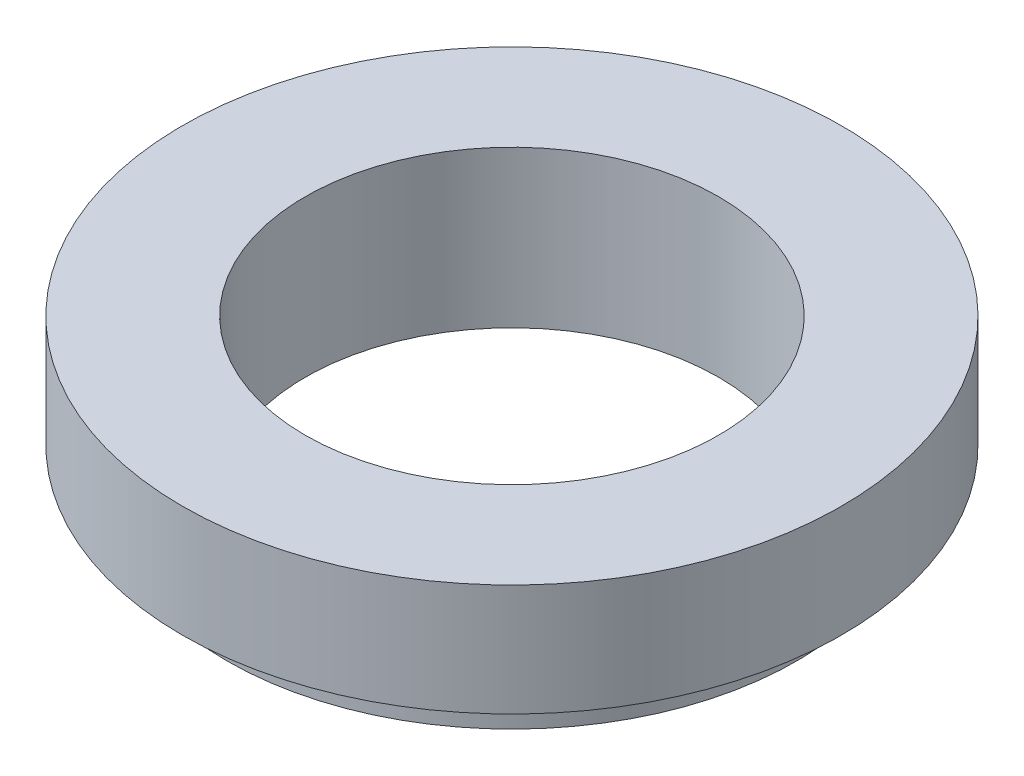
ISO-10303-21;
HEADER;
FILE_DESCRIPTION(('STEP AP214'),'2;1');
FILE_NAME('part.step','',(''),(''),'','','');
FILE_SCHEMA(('AUTOMOTIVE_DESIGN { 1 0 10303 214 1 1 1 1 }'));
ENDSEC;
DATA;
#1=APPLICATION_CONTEXT('core data for automotive mechanical design processes');
#2=APPLICATION_PROTOCOL_DEFINITION('international standard','automotive_design',2000,#1);
#3=PRODUCT_CONTEXT('',#1,'mechanical');
#4=PRODUCT('Part','Part','',(#3));
#5=PRODUCT_RELATED_PRODUCT_CATEGORY('part','',(#4));
#6=PRODUCT_DEFINITION_FORMATION('','',#4);
#7=PRODUCT_DEFINITION_CONTEXT('part definition',#1,'design');
#8=PRODUCT_DEFINITION('design','',#6,#7);
#9=PRODUCT_DEFINITION_SHAPE('','',#8);
#10=(LENGTH_UNIT() NAMED_UNIT(*) SI_UNIT(.MILLI.,.METRE.));
#11=(NAMED_UNIT(*) PLANE_ANGLE_UNIT() SI_UNIT($,.RADIAN.));
#12=(NAMED_UNIT(*) SI_UNIT($,.STERADIAN.) SOLID_ANGLE_UNIT());
#13=UNCERTAINTY_MEASURE_WITH_UNIT(LENGTH_MEASURE(1.E-05),#10,'distance_accuracy_value','');
#14=(GEOMETRIC_REPRESENTATION_CONTEXT(3) GLOBAL_UNCERTAINTY_ASSIGNED_CONTEXT((#13)) GLOBAL_UNIT_ASSIGNED_CONTEXT((#10,
#11,#12)) REPRESENTATION_CONTEXT('',''));
#15=CARTESIAN_POINT('',(0.,0.,0.));
#16=DIRECTION('',(0.,0.,1.));
#17=DIRECTION('',(1.,0.,0.));
#18=AXIS2_PLACEMENT_3D('',#15,#16,#17);
#19=CARTESIAN_POINT('',(29.5000000000003,0.,0.));
#20=DIRECTION('',(0.,-1.,0.));
#21=DIRECTION('',(0.,0.,-1.00000000000001));
#22=AXIS2_PLACEMENT_3D('',#19,#20,#21);
#23=PLANE('',#22);
#24=CARTESIAN_POINT('',(0.,0.,0.));
#25=DIRECTION('',(0.,1.,0.));
#26=DIRECTION('',(0.,0.,1.00000000000001));
#27=AXIS2_PLACEMENT_3D('',#24,#25,#26);
#28=CIRCLE('',#27,18.5);
#29=CARTESIAN_POINT('',(0.,0.,18.5000000000001));
#30=VERTEX_POINT('',#29);
#31=EDGE_CURVE('E12',#30,#30,#28,.T.);
#32=ORIENTED_EDGE('',*,*,#31,.F.);
#33=EDGE_LOOP('',(#32));
#34=FACE_BOUND('',#33,.T.);
#35=CARTESIAN_POINT('',(0.,0.,0.));
#36=DIRECTION('',(0.,1.,0.));
#37=DIRECTION('',(0.,0.,1.00000000000001));
#38=AXIS2_PLACEMENT_3D('',#35,#36,#37);
#39=CIRCLE('',#38,29.5);
#40=CARTESIAN_POINT('',(0.,0.,29.5000000000002));
#41=VERTEX_POINT('',#40);
#42=EDGE_CURVE('E63',#41,#41,#39,.T.);
#43=ORIENTED_EDGE('',*,*,#42,.T.);
#44=EDGE_LOOP('',(#43));
#45=FACE_BOUND('',#44,.T.);
#46=ADVANCED_FACE('F41',(#34,#45),#23,.F.);
#47=CARTESIAN_POINT('',(0.,0.,0.));
#48=DIRECTION('',(0.,1.,0.));
#49=DIRECTION('',(0.,0.,1.00000000000001));
#50=AXIS2_PLACEMENT_3D('',#47,#48,#49);
#51=CYLINDRICAL_SURFACE('',#50,18.5);
#52=CARTESIAN_POINT('',(0.,-14.,0.));
#53=DIRECTION('',(0.,1.,0.));
#54=DIRECTION('',(0.,0.,1.00000000000001));
#55=AXIS2_PLACEMENT_3D('',#52,#53,#54);
#56=CIRCLE('',#55,18.5);
#57=CARTESIAN_POINT('',(0.,-14.,18.5000000000001));
#58=VERTEX_POINT('',#57);
#59=EDGE_CURVE('E47',#58,#58,#56,.T.);
#60=ORIENTED_EDGE('',*,*,#59,.F.);
#61=EDGE_LOOP('',(#60));
#62=FACE_BOUND('',#61,.T.);
#63=ORIENTED_EDGE('',*,*,#31,.T.);
#64=EDGE_LOOP('',(#63));
#65=FACE_BOUND('',#64,.T.);
#66=ADVANCED_FACE('F88',(#62,#65),#51,.F.);
#67=CARTESIAN_POINT('',(18.5000000000001,-14.,0.));
#68=DIRECTION('',(0.,1.,0.));
#69=DIRECTION('',(0.,0.,1.00000000000001));
#70=AXIS2_PLACEMENT_3D('',#67,#68,#69);
#71=PLANE('',#70);
#72=CARTESIAN_POINT('',(0.,-14.,0.));
#73=DIRECTION('',(0.,1.,0.));
#74=DIRECTION('',(0.,0.,1.00000000000001));
#75=AXIS2_PLACEMENT_3D('',#72,#73,#74);
#76=CIRCLE('',#75,25.5);
#77=CARTESIAN_POINT('',(0.,-14.,25.5000000000002));
#78=VERTEX_POINT('',#77);
#79=EDGE_CURVE('E51',#78,#78,#76,.T.);
#80=ORIENTED_EDGE('',*,*,#79,.F.);
#81=EDGE_LOOP('',(#80));
#82=FACE_BOUND('',#81,.T.);
#83=ORIENTED_EDGE('',*,*,#59,.T.);
#84=EDGE_LOOP('',(#83));
#85=FACE_BOUND('',#84,.T.);
#86=ADVANCED_FACE('F83',(#82,#85),#71,.F.);
#87=CARTESIAN_POINT('',(0.,0.,0.));
#88=DIRECTION('',(0.,1.,0.));
#89=DIRECTION('',(0.,0.,1.00000000000001));
#90=AXIS2_PLACEMENT_3D('',#87,#88,#89);
#91=CYLINDRICAL_SURFACE('',#90,25.5);
#92=CARTESIAN_POINT('',(0.,-9.99999999999999,0.));
#93=DIRECTION('',(0.,1.,0.));
#94=DIRECTION('',(0.,0.,1.00000000000001));
#95=AXIS2_PLACEMENT_3D('',#92,#93,#94);
#96=CIRCLE('',#95,25.5);
#97=CARTESIAN_POINT('',(0.,-9.99999999999999,25.5000000000002));
#98=VERTEX_POINT('',#97);
#99=EDGE_CURVE('E55',#98,#98,#96,.T.);
#100=ORIENTED_EDGE('',*,*,#99,.F.);
#101=EDGE_LOOP('',(#100));
#102=FACE_BOUND('',#101,.T.);
#103=ORIENTED_EDGE('',*,*,#79,.T.);
#104=EDGE_LOOP('',(#103));
#105=FACE_BOUND('',#104,.T.);
#106=ADVANCED_FACE('F77',(#102,#105),#91,.T.);
#107=CARTESIAN_POINT('',(25.5000000000002,-9.99999999999999,0.));
#108=DIRECTION('',(0.,1.,0.));
#109=DIRECTION('',(0.,0.,1.00000000000001));
#110=AXIS2_PLACEMENT_3D('',#107,#108,#109);
#111=PLANE('',#110);
#112=CARTESIAN_POINT('',(0.,-9.99999999999999,0.));
#113=DIRECTION('',(0.,1.,0.));
#114=DIRECTION('',(0.,0.,1.00000000000001));
#115=AXIS2_PLACEMENT_3D('',#112,#113,#114);
#116=CIRCLE('',#115,29.5);
#117=CARTESIAN_POINT('',(0.,-9.99999999999999,29.5000000000002));
#118=VERTEX_POINT('',#117);
#119=EDGE_CURVE('E60',#118,#118,#116,.T.);
#120=ORIENTED_EDGE('',*,*,#119,.F.);
#121=EDGE_LOOP('',(#120));
#122=FACE_BOUND('',#121,.T.);
#123=ORIENTED_EDGE('',*,*,#99,.T.);
#124=EDGE_LOOP('',(#123));
#125=FACE_BOUND('',#124,.T.);
#126=ADVANCED_FACE('F71',(#122,#125),#111,.F.);
#127=CARTESIAN_POINT('',(0.,0.,0.));
#128=DIRECTION('',(0.,1.,0.));
#129=DIRECTION('',(0.,0.,1.00000000000001));
#130=AXIS2_PLACEMENT_3D('',#127,#128,#129);
#131=CYLINDRICAL_SURFACE('',#130,29.5);
#132=ORIENTED_EDGE('',*,*,#42,.F.);
#133=EDGE_LOOP('',(#132));
#134=FACE_BOUND('',#133,.T.);
#135=ORIENTED_EDGE('',*,*,#119,.T.);
#136=EDGE_LOOP('',(#135));
#137=FACE_BOUND('',#136,.T.);
#138=ADVANCED_FACE('F68',(#134,#137),#131,.T.);
#139=CLOSED_SHELL('',(#46,#66,#86,#106,#126,#138));
#140=MANIFOLD_SOLID_BREP('B2',#139);
#141=ADVANCED_BREP_SHAPE_REPRESENTATION('',(#18,#140),#14);
#142=SHAPE_DEFINITION_REPRESENTATION(#9,#141);
ENDSEC;
END-ISO-10303-21;
